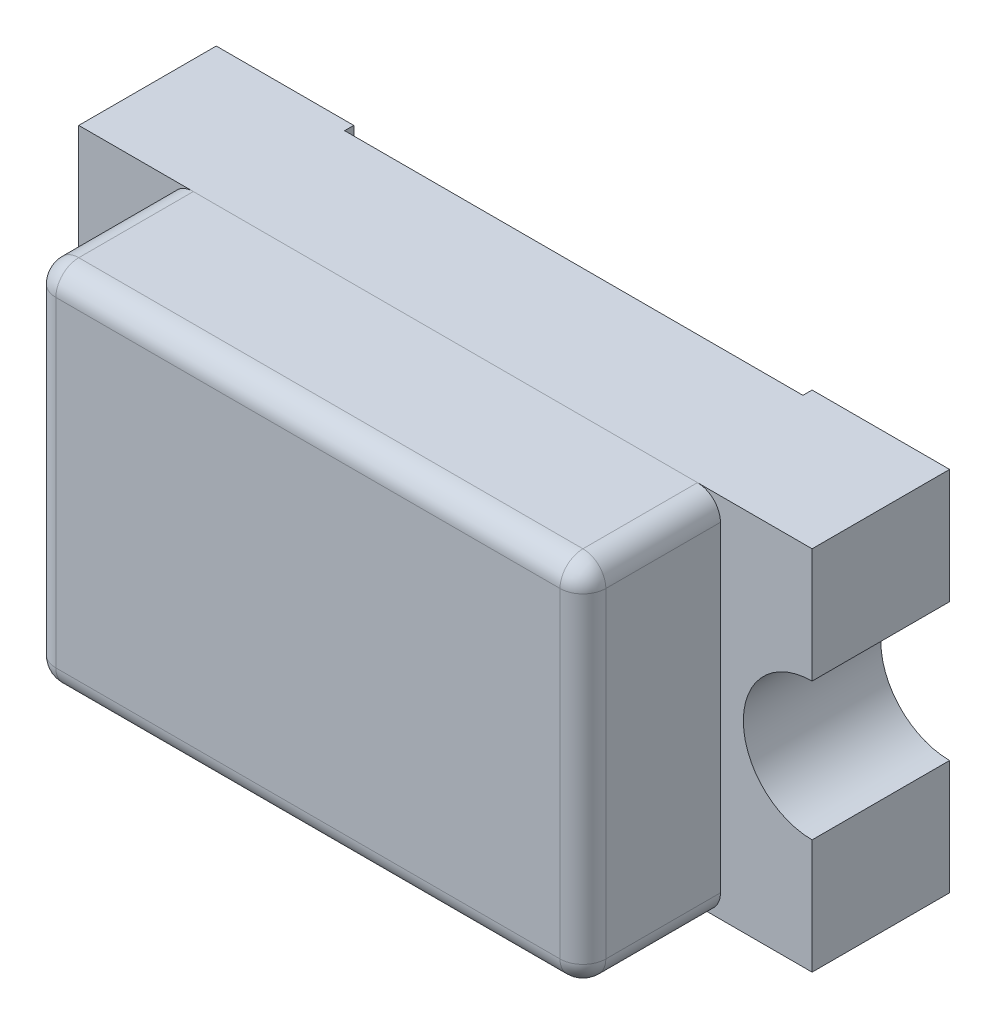
ISO-10303-21;
HEADER;
FILE_DESCRIPTION(('STEP AP214'),'2;1');
FILE_NAME('part.step','',(''),(''),'','','');
FILE_SCHEMA(('AUTOMOTIVE_DESIGN { 1 0 10303 214 1 1 1 1 }'));
ENDSEC;
DATA;
#1=APPLICATION_CONTEXT('core data for automotive mechanical design processes');
#2=APPLICATION_PROTOCOL_DEFINITION('international standard','automotive_design',2000,#1);
#3=PRODUCT_CONTEXT('',#1,'mechanical');
#4=PRODUCT('Part','Part','',(#3));
#5=PRODUCT_RELATED_PRODUCT_CATEGORY('part','',(#4));
#6=PRODUCT_DEFINITION_FORMATION('','',#4);
#7=PRODUCT_DEFINITION_CONTEXT('part definition',#1,'design');
#8=PRODUCT_DEFINITION('design','',#6,#7);
#9=PRODUCT_DEFINITION_SHAPE('','',#8);
#10=(LENGTH_UNIT() NAMED_UNIT(*) SI_UNIT(.MILLI.,.METRE.));
#11=(NAMED_UNIT(*) PLANE_ANGLE_UNIT() SI_UNIT($,.RADIAN.));
#12=(NAMED_UNIT(*) SI_UNIT($,.STERADIAN.) SOLID_ANGLE_UNIT());
#13=UNCERTAINTY_MEASURE_WITH_UNIT(LENGTH_MEASURE(1.E-05),#10,'distance_accuracy_value','');
#14=(GEOMETRIC_REPRESENTATION_CONTEXT(3) GLOBAL_UNCERTAINTY_ASSIGNED_CONTEXT((#13)) GLOBAL_UNIT_ASSIGNED_CONTEXT((#10,
#11,#12)) REPRESENTATION_CONTEXT('',''));
#15=CARTESIAN_POINT('',(0.,0.,0.));
#16=DIRECTION('',(0.,0.,1.));
#17=DIRECTION('',(1.,0.,0.));
#18=AXIS2_PLACEMENT_3D('',#15,#16,#17);
#19=CARTESIAN_POINT('',(-0.6,-0.4,0.6));
#20=DIRECTION('',(0.,0.,1.));
#21=DIRECTION('',(1.,0.,0.));
#22=AXIS2_PLACEMENT_3D('',#19,#20,#21);
#23=PLANE('',#22);
#24=DIRECTION('',(0.,1.,0.));
#25=VECTOR('',#24,1.);
#26=CARTESIAN_POINT('',(-0.55,-0.4,0.6));
#27=LINE('',#26,#25);
#28=CARTESIAN_POINT('',(-0.55,-0.35,0.6));
#29=VERTEX_POINT('',#28);
#30=CARTESIAN_POINT('',(-0.55,0.350000000000096,0.6));
#31=VERTEX_POINT('',#30);
#32=EDGE_CURVE('P0_E101',#29,#31,#27,.T.);
#33=ORIENTED_EDGE('',*,*,#32,.F.);
#34=DIRECTION('',(1.,0.,0.));
#35=VECTOR('',#34,1.);
#36=CARTESIAN_POINT('',(-0.6,-0.35,0.6));
#37=LINE('',#36,#35);
#38=CARTESIAN_POINT('',(0.55,-0.35,0.6));
#39=VERTEX_POINT('',#38);
#40=EDGE_CURVE('P0_E143',#39,#29,#37,.F.);
#41=ORIENTED_EDGE('',*,*,#40,.F.);
#42=DIRECTION('',(0.,1.,0.));
#43=VECTOR('',#42,1.);
#44=CARTESIAN_POINT('',(0.55,-0.4,0.6));
#45=LINE('',#44,#43);
#46=CARTESIAN_POINT('',(0.55,0.350000000000048,0.6));
#47=VERTEX_POINT('',#46);
#48=EDGE_CURVE('P0_E116',#47,#39,#45,.F.);
#49=ORIENTED_EDGE('',*,*,#48,.F.);
#50=DIRECTION('',(1.,0.,0.));
#51=VECTOR('',#50,1.);
#52=CARTESIAN_POINT('',(-0.6,0.350000000000096,0.6));
#53=LINE('',#52,#51);
#54=EDGE_CURVE('P0_E113',#31,#47,#53,.T.);
#55=ORIENTED_EDGE('',*,*,#54,.F.);
#56=EDGE_LOOP('',(#33,#41,#49,#55));
#57=FACE_BOUND('',#56,.T.);
#58=ADVANCED_FACE('P0_F17',(#57),#23,.T.);
#59=CARTESIAN_POINT('',(-0.55,0.35,0.55));
#60=DIRECTION('',(-1.,0.,0.));
#61=DIRECTION('',(0.,-3.82940633443145E-12,-1.));
#62=AXIS2_PLACEMENT_3D('',#59,#60,#61);
#63=SPHERICAL_SURFACE('',#62,0.0499999999999998);
#64=CARTESIAN_POINT('',(-0.55,0.35,0.55));
#65=DIRECTION('',(0.,0.,1.));
#66=DIRECTION('',(1.,0.,0.));
#67=AXIS2_PLACEMENT_3D('',#64,#65,#66);
#68=CIRCLE('',#67,0.05);
#69=CARTESIAN_POINT('',(-0.6,0.350000000000024,0.55));
#70=VERTEX_POINT('',#69);
#71=CARTESIAN_POINT('',(-0.55,0.4,0.55));
#72=VERTEX_POINT('',#71);
#73=EDGE_CURVE('P0_E118',#70,#72,#68,.F.);
#74=ORIENTED_EDGE('',*,*,#73,.F.);
#75=CARTESIAN_POINT('',(-0.55,0.350000000000096,0.55));
#76=DIRECTION('',(0.,1.,0.));
#77=DIRECTION('',(0.,0.,1.));
#78=AXIS2_PLACEMENT_3D('',#75,#76,#77);
#79=CIRCLE('',#78,0.05);
#80=EDGE_CURVE('P0_E106',#31,#70,#79,.F.);
#81=ORIENTED_EDGE('',*,*,#80,.F.);
#82=CARTESIAN_POINT('',(-0.55,0.35,0.55));
#83=DIRECTION('',(1.,0.,0.));
#84=DIRECTION('',(0.,0.,-1.));
#85=AXIS2_PLACEMENT_3D('',#82,#83,#84);
#86=CIRCLE('',#85,0.05);
#87=EDGE_CURVE('P0_E119',#72,#31,#86,.T.);
#88=ORIENTED_EDGE('',*,*,#87,.F.);
#89=EDGE_LOOP('',(#74,#81,#88));
#90=FACE_BOUND('',#89,.T.);
#91=ADVANCED_FACE('P0_F127',(#90),#63,.T.);
#92=CARTESIAN_POINT('',(-0.55,-0.4,0.55));
#93=DIRECTION('',(0.,1.,0.));
#94=DIRECTION('',(0.,0.,1.));
#95=AXIS2_PLACEMENT_3D('',#92,#93,#94);
#96=CYLINDRICAL_SURFACE('',#95,0.05);
#97=CARTESIAN_POINT('',(-0.55,-0.35,0.55));
#98=DIRECTION('',(0.,-1.,0.));
#99=DIRECTION('',(0.,0.,-1.));
#100=AXIS2_PLACEMENT_3D('',#97,#98,#99);
#101=CIRCLE('',#100,0.05);
#102=CARTESIAN_POINT('',(-0.6,-0.35,0.55));
#103=VERTEX_POINT('',#102);
#104=EDGE_CURVE('P0_E108',#29,#103,#101,.T.);
#105=ORIENTED_EDGE('',*,*,#104,.F.);
#106=ORIENTED_EDGE('',*,*,#32,.T.);
#107=ORIENTED_EDGE('',*,*,#80,.T.);
#108=DIRECTION('',(0.,1.,0.));
#109=VECTOR('',#108,1.);
#110=CARTESIAN_POINT('',(-0.6,-0.4,0.55));
#111=LINE('',#110,#109);
#112=EDGE_CURVE('P0_E205',#70,#103,#111,.F.);
#113=ORIENTED_EDGE('',*,*,#112,.T.);
#114=EDGE_LOOP('',(#105,#106,#107,#113));
#115=FACE_BOUND('',#114,.T.);
#116=ADVANCED_FACE('P0_F103',(#115),#96,.T.);
#117=CARTESIAN_POINT('',(-0.55,-0.35,0.55));
#118=DIRECTION('',(-1.,0.,0.));
#119=DIRECTION('',(0.,1.,0.));
#120=AXIS2_PLACEMENT_3D('',#117,#118,#119);
#121=SPHERICAL_SURFACE('',#120,0.05);
#122=ORIENTED_EDGE('',*,*,#104,.T.);
#123=CARTESIAN_POINT('',(-0.55,-0.35,0.55));
#124=DIRECTION('',(0.,0.,1.));
#125=DIRECTION('',(1.,0.,0.));
#126=AXIS2_PLACEMENT_3D('',#123,#124,#125);
#127=CIRCLE('',#126,0.05);
#128=CARTESIAN_POINT('',(-0.55,-0.4,0.55));
#129=VERTEX_POINT('',#128);
#130=EDGE_CURVE('P0_E199',#129,#103,#127,.F.);
#131=ORIENTED_EDGE('',*,*,#130,.F.);
#132=CARTESIAN_POINT('',(-0.55,-0.35,0.55));
#133=DIRECTION('',(1.,0.,0.));
#134=DIRECTION('',(0.,0.,-1.));
#135=AXIS2_PLACEMENT_3D('',#132,#133,#134);
#136=CIRCLE('',#135,0.05);
#137=EDGE_CURVE('P0_E145',#29,#129,#136,.T.);
#138=ORIENTED_EDGE('',*,*,#137,.F.);
#139=EDGE_LOOP('',(#122,#131,#138));
#140=FACE_BOUND('',#139,.T.);
#141=ADVANCED_FACE('P0_F256',(#140),#121,.T.);
#142=CARTESIAN_POINT('',(-0.6,-0.35,0.55));
#143=DIRECTION('',(1.,0.,0.));
#144=DIRECTION('',(0.,0.,-1.));
#145=AXIS2_PLACEMENT_3D('',#142,#143,#144);
#146=CYLINDRICAL_SURFACE('',#145,0.05);
#147=DIRECTION('',(1.,0.,0.));
#148=VECTOR('',#147,1.);
#149=CARTESIAN_POINT('',(-0.6,-0.4,0.55));
#150=LINE('',#149,#148);
#151=CARTESIAN_POINT('',(0.55,-0.4,0.55));
#152=VERTEX_POINT('',#151);
#153=EDGE_CURVE('P0_E190',#129,#152,#150,.T.);
#154=ORIENTED_EDGE('',*,*,#153,.T.);
#155=CARTESIAN_POINT('',(0.55,-0.35,0.55));
#156=DIRECTION('',(1.,0.,0.));
#157=DIRECTION('',(0.,0.,-1.));
#158=AXIS2_PLACEMENT_3D('',#155,#156,#157);
#159=CIRCLE('',#158,0.0500000000000001);
#160=EDGE_CURVE('P0_E140',#39,#152,#159,.T.);
#161=ORIENTED_EDGE('',*,*,#160,.F.);
#162=ORIENTED_EDGE('',*,*,#40,.T.);
#163=ORIENTED_EDGE('',*,*,#137,.T.);
#164=EDGE_LOOP('',(#154,#161,#162,#163));
#165=FACE_BOUND('',#164,.T.);
#166=ADVANCED_FACE('P0_F310',(#165),#146,.T.);
#167=CARTESIAN_POINT('',(0.55,-0.35,0.55));
#168=DIRECTION('',(1.,0.,0.));
#169=DIRECTION('',(0.,0.,-1.));
#170=AXIS2_PLACEMENT_3D('',#167,#168,#169);
#171=SPHERICAL_SURFACE('',#170,0.0500000000000001);
#172=CARTESIAN_POINT('',(0.55,-0.35,0.55));
#173=DIRECTION('',(0.,0.,1.));
#174=DIRECTION('',(1.,0.,0.));
#175=AXIS2_PLACEMENT_3D('',#172,#173,#174);
#176=CIRCLE('',#175,0.05);
#177=CARTESIAN_POINT('',(0.6,-0.35,0.55));
#178=VERTEX_POINT('',#177);
#179=EDGE_CURVE('P0_E189',#178,#152,#176,.F.);
#180=ORIENTED_EDGE('',*,*,#179,.F.);
#181=CARTESIAN_POINT('',(0.55,-0.35,0.55));
#182=DIRECTION('',(0.,1.,0.));
#183=DIRECTION('',(0.,0.,1.));
#184=AXIS2_PLACEMENT_3D('',#181,#182,#183);
#185=CIRCLE('',#184,0.05);
#186=EDGE_CURVE('P0_E139',#39,#178,#185,.T.);
#187=ORIENTED_EDGE('',*,*,#186,.F.);
#188=ORIENTED_EDGE('',*,*,#160,.T.);
#189=EDGE_LOOP('',(#180,#187,#188));
#190=FACE_BOUND('',#189,.T.);
#191=ADVANCED_FACE('P0_F307',(#190),#171,.T.);
#192=CARTESIAN_POINT('',(0.55,-0.4,0.55));
#193=DIRECTION('',(0.,1.,0.));
#194=DIRECTION('',(0.,0.,1.));
#195=AXIS2_PLACEMENT_3D('',#192,#193,#194);
#196=CYLINDRICAL_SURFACE('',#195,0.05);
#197=DIRECTION('',(0.,1.,0.));
#198=VECTOR('',#197,1.);
#199=CARTESIAN_POINT('',(0.6,-0.4,0.55));
#200=LINE('',#199,#198);
#201=CARTESIAN_POINT('',(0.6,0.35,0.55));
#202=VERTEX_POINT('',#201);
#203=EDGE_CURVE('P0_E184',#202,#178,#200,.F.);
#204=ORIENTED_EDGE('',*,*,#203,.F.);
#205=CARTESIAN_POINT('',(0.55,0.35,0.55));
#206=DIRECTION('',(0.,1.,0.));
#207=DIRECTION('',(0.,0.,1.));
#208=AXIS2_PLACEMENT_3D('',#205,#206,#207);
#209=CIRCLE('',#208,0.0499999999999999);
#210=EDGE_CURVE('P0_E221',#47,#202,#209,.T.);
#211=ORIENTED_EDGE('',*,*,#210,.F.);
#212=ORIENTED_EDGE('',*,*,#48,.T.);
#213=ORIENTED_EDGE('',*,*,#186,.T.);
#214=EDGE_LOOP('',(#204,#211,#212,#213));
#215=FACE_BOUND('',#214,.T.);
#216=ADVANCED_FACE('P0_F313',(#215),#196,.T.);
#217=CARTESIAN_POINT('',(0.55,0.35,0.55));
#218=DIRECTION('',(1.,0.,0.));
#219=DIRECTION('',(0.,-1.,0.));
#220=AXIS2_PLACEMENT_3D('',#217,#218,#219);
#221=SPHERICAL_SURFACE('',#220,0.0499999999999999);
#222=ORIENTED_EDGE('',*,*,#210,.T.);
#223=CARTESIAN_POINT('',(0.55,0.35,0.55));
#224=DIRECTION('',(0.,0.,1.));
#225=DIRECTION('',(1.,0.,0.));
#226=AXIS2_PLACEMENT_3D('',#223,#224,#225);
#227=CIRCLE('',#226,0.05);
#228=CARTESIAN_POINT('',(0.55,0.4,0.55));
#229=VERTEX_POINT('',#228);
#230=EDGE_CURVE('P0_E179',#229,#202,#227,.F.);
#231=ORIENTED_EDGE('',*,*,#230,.F.);
#232=CARTESIAN_POINT('',(0.55,0.35,0.55));
#233=DIRECTION('',(1.,0.,0.));
#234=DIRECTION('',(0.,0.,-1.));
#235=AXIS2_PLACEMENT_3D('',#232,#233,#234);
#236=CIRCLE('',#235,0.05);
#237=EDGE_CURVE('P0_E67',#47,#229,#236,.F.);
#238=ORIENTED_EDGE('',*,*,#237,.F.);
#239=EDGE_LOOP('',(#222,#231,#238));
#240=FACE_BOUND('',#239,.T.);
#241=ADVANCED_FACE('P0_F19',(#240),#221,.T.);
#242=CARTESIAN_POINT('',(-0.6,0.35,0.55));
#243=DIRECTION('',(1.,0.,0.));
#244=DIRECTION('',(0.,0.,-1.));
#245=AXIS2_PLACEMENT_3D('',#242,#243,#244);
#246=CYLINDRICAL_SURFACE('',#245,0.05);
#247=ORIENTED_EDGE('',*,*,#87,.T.);
#248=ORIENTED_EDGE('',*,*,#54,.T.);
#249=ORIENTED_EDGE('',*,*,#237,.T.);
#250=DIRECTION('',(1.,0.,0.));
#251=VECTOR('',#250,1.);
#252=CARTESIAN_POINT('',(-0.6,0.4,0.55));
#253=LINE('',#252,#251);
#254=EDGE_CURVE('P0_E123',#72,#229,#253,.T.);
#255=ORIENTED_EDGE('',*,*,#254,.F.);
#256=EDGE_LOOP('',(#247,#248,#249,#255));
#257=FACE_BOUND('',#256,.T.);
#258=ADVANCED_FACE('P0_F122',(#257),#246,.T.);
#259=CARTESIAN_POINT('',(-0.55,0.35,0.3));
#260=DIRECTION('',(0.,0.,1.));
#261=DIRECTION('',(1.,0.,0.));
#262=AXIS2_PLACEMENT_3D('',#259,#260,#261);
#263=CYLINDRICAL_SURFACE('',#262,0.05);
#264=DIRECTION('',(0.,0.,-1.));
#265=VECTOR('',#264,1.);
#266=CARTESIAN_POINT('',(-0.6,0.35,0.3));
#267=LINE('',#266,#265);
#268=CARTESIAN_POINT('',(-0.6,0.35,0.3));
#269=VERTEX_POINT('',#268);
#270=EDGE_CURVE('P0_E202',#269,#70,#267,.F.);
#271=ORIENTED_EDGE('',*,*,#270,.T.);
#272=ORIENTED_EDGE('',*,*,#73,.T.);
#273=DIRECTION('',(0.,0.,1.));
#274=VECTOR('',#273,1.);
#275=CARTESIAN_POINT('',(-0.55,0.4,0.3));
#276=LINE('',#275,#274);
#277=CARTESIAN_POINT('',(-0.55,0.4,0.3));
#278=VERTEX_POINT('',#277);
#279=EDGE_CURVE('P0_E168',#278,#72,#276,.T.);
#280=ORIENTED_EDGE('',*,*,#279,.F.);
#281=CARTESIAN_POINT('',(-0.55,0.35,0.3));
#282=DIRECTION('',(0.,0.,1.));
#283=DIRECTION('',(1.,0.,0.));
#284=AXIS2_PLACEMENT_3D('',#281,#282,#283);
#285=CIRCLE('',#284,0.05);
#286=EDGE_CURVE('P0_E21',#278,#269,#285,.T.);
#287=ORIENTED_EDGE('',*,*,#286,.T.);
#288=EDGE_LOOP('',(#271,#272,#280,#287));
#289=FACE_BOUND('',#288,.T.);
#290=ADVANCED_FACE('P0_F261',(#289),#263,.T.);
#291=CARTESIAN_POINT('',(-0.6,-0.4,0.3));
#292=DIRECTION('',(1.,0.,0.));
#293=DIRECTION('',(0.,0.,-1.));
#294=AXIS2_PLACEMENT_3D('',#291,#292,#293);
#295=PLANE('',#294);
#296=ORIENTED_EDGE('',*,*,#270,.F.);
#297=DIRECTION('',(0.,1.,0.));
#298=VECTOR('',#297,1.);
#299=CARTESIAN_POINT('',(-0.6,-0.4,0.3));
#300=LINE('',#299,#298);
#301=CARTESIAN_POINT('',(-0.6,-0.35,0.3));
#302=VERTEX_POINT('',#301);
#303=EDGE_CURVE('P0_E158',#269,#302,#300,.F.);
#304=ORIENTED_EDGE('',*,*,#303,.T.);
#305=DIRECTION('',(0.,0.,1.));
#306=VECTOR('',#305,1.);
#307=CARTESIAN_POINT('',(-0.6,-0.35,0.3));
#308=LINE('',#307,#306);
#309=EDGE_CURVE('P0_E195',#103,#302,#308,.F.);
#310=ORIENTED_EDGE('',*,*,#309,.F.);
#311=ORIENTED_EDGE('',*,*,#112,.F.);
#312=EDGE_LOOP('',(#296,#304,#310,#311));
#313=FACE_BOUND('',#312,.T.);
#314=ADVANCED_FACE('P0_F259',(#313),#295,.F.);
#315=CARTESIAN_POINT('',(-0.55,-0.35,0.3));
#316=DIRECTION('',(0.,0.,1.));
#317=DIRECTION('',(1.,0.,0.));
#318=AXIS2_PLACEMENT_3D('',#315,#316,#317);
#319=CYLINDRICAL_SURFACE('',#318,0.05);
#320=CARTESIAN_POINT('',(-0.55,-0.35,0.3));
#321=DIRECTION('',(0.,0.,1.));
#322=DIRECTION('',(1.,0.,0.));
#323=AXIS2_PLACEMENT_3D('',#320,#321,#322);
#324=CIRCLE('',#323,0.05);
#325=CARTESIAN_POINT('',(-0.55,-0.4,0.3));
#326=VERTEX_POINT('',#325);
#327=EDGE_CURVE('P0_E156',#302,#326,#324,.T.);
#328=ORIENTED_EDGE('',*,*,#327,.T.);
#329=DIRECTION('',(0.,0.,1.));
#330=VECTOR('',#329,1.);
#331=CARTESIAN_POINT('',(-0.55,-0.4,0.3));
#332=LINE('',#331,#330);
#333=EDGE_CURVE('P0_E193',#326,#129,#332,.T.);
#334=ORIENTED_EDGE('',*,*,#333,.T.);
#335=ORIENTED_EDGE('',*,*,#130,.T.);
#336=ORIENTED_EDGE('',*,*,#309,.T.);
#337=EDGE_LOOP('',(#328,#334,#335,#336));
#338=FACE_BOUND('',#337,.T.);
#339=ADVANCED_FACE('P0_F258',(#338),#319,.T.);
#340=CARTESIAN_POINT('',(-0.6,-0.4,0.3));
#341=DIRECTION('',(0.,1.,0.));
#342=DIRECTION('',(0.,0.,1.));
#343=AXIS2_PLACEMENT_3D('',#340,#341,#342);
#344=PLANE('',#343);
#345=ORIENTED_EDGE('',*,*,#333,.F.);
#346=DIRECTION('',(1.,0.,0.));
#347=VECTOR('',#346,1.);
#348=CARTESIAN_POINT('',(-0.6,-0.4,0.3));
#349=LINE('',#348,#347);
#350=CARTESIAN_POINT('',(0.55,-0.4,0.3));
#351=VERTEX_POINT('',#350);
#352=EDGE_CURVE('P0_E155',#326,#351,#349,.T.);
#353=ORIENTED_EDGE('',*,*,#352,.T.);
#354=DIRECTION('',(0.,0.,1.));
#355=VECTOR('',#354,1.);
#356=CARTESIAN_POINT('',(0.55,-0.4,0.3));
#357=LINE('',#356,#355);
#358=EDGE_CURVE('P0_E187',#152,#351,#357,.F.);
#359=ORIENTED_EDGE('',*,*,#358,.F.);
#360=ORIENTED_EDGE('',*,*,#153,.F.);
#361=EDGE_LOOP('',(#345,#353,#359,#360));
#362=FACE_BOUND('',#361,.T.);
#363=ADVANCED_FACE('P0_F268',(#362),#344,.F.);
#364=CARTESIAN_POINT('',(0.55,-0.35,0.3));
#365=DIRECTION('',(0.,0.,1.));
#366=DIRECTION('',(1.,0.,0.));
#367=AXIS2_PLACEMENT_3D('',#364,#365,#366);
#368=CYLINDRICAL_SURFACE('',#367,0.05);
#369=DIRECTION('',(0.,0.,-1.));
#370=VECTOR('',#369,1.);
#371=CARTESIAN_POINT('',(0.6,-0.35,0.3));
#372=LINE('',#371,#370);
#373=CARTESIAN_POINT('',(0.6,-0.35,0.3));
#374=VERTEX_POINT('',#373);
#375=EDGE_CURVE('P0_E182',#178,#374,#372,.T.);
#376=ORIENTED_EDGE('',*,*,#375,.F.);
#377=ORIENTED_EDGE('',*,*,#179,.T.);
#378=ORIENTED_EDGE('',*,*,#358,.T.);
#379=CARTESIAN_POINT('',(0.55,-0.35,0.3));
#380=DIRECTION('',(0.,0.,1.));
#381=DIRECTION('',(1.,0.,0.));
#382=AXIS2_PLACEMENT_3D('',#379,#380,#381);
#383=CIRCLE('',#382,0.05);
#384=EDGE_CURVE('P0_E153',#351,#374,#383,.T.);
#385=ORIENTED_EDGE('',*,*,#384,.T.);
#386=EDGE_LOOP('',(#376,#377,#378,#385));
#387=FACE_BOUND('',#386,.T.);
#388=ADVANCED_FACE('P0_F289',(#387),#368,.T.);
#389=CARTESIAN_POINT('',(0.6,-0.4,0.3));
#390=DIRECTION('',(1.,0.,0.));
#391=DIRECTION('',(0.,0.,-1.));
#392=AXIS2_PLACEMENT_3D('',#389,#390,#391);
#393=PLANE('',#392);
#394=DIRECTION('',(0.,1.,0.));
#395=VECTOR('',#394,1.);
#396=CARTESIAN_POINT('',(0.6,-0.4,0.3));
#397=LINE('',#396,#395);
#398=CARTESIAN_POINT('',(0.6,0.35,0.3));
#399=VERTEX_POINT('',#398);
#400=EDGE_CURVE('P0_E152',#374,#399,#397,.T.);
#401=ORIENTED_EDGE('',*,*,#400,.T.);
#402=DIRECTION('',(0.,0.,1.));
#403=VECTOR('',#402,1.);
#404=CARTESIAN_POINT('',(0.6,0.35,0.3));
#405=LINE('',#404,#403);
#406=EDGE_CURVE('P0_E177',#202,#399,#405,.F.);
#407=ORIENTED_EDGE('',*,*,#406,.F.);
#408=ORIENTED_EDGE('',*,*,#203,.T.);
#409=ORIENTED_EDGE('',*,*,#375,.T.);
#410=EDGE_LOOP('',(#401,#407,#408,#409));
#411=FACE_BOUND('',#410,.T.);
#412=ADVANCED_FACE('P0_F285',(#411),#393,.T.);
#413=CARTESIAN_POINT('',(0.55,0.35,0.3));
#414=DIRECTION('',(0.,0.,1.));
#415=DIRECTION('',(1.,0.,0.));
#416=AXIS2_PLACEMENT_3D('',#413,#414,#415);
#417=CYLINDRICAL_SURFACE('',#416,0.05);
#418=CARTESIAN_POINT('',(0.55,0.35,0.3));
#419=DIRECTION('',(0.,0.,1.));
#420=DIRECTION('',(1.,0.,0.));
#421=AXIS2_PLACEMENT_3D('',#418,#419,#420);
#422=CIRCLE('',#421,0.05);
#423=CARTESIAN_POINT('',(0.55,0.4,0.3));
#424=VERTEX_POINT('',#423);
#425=EDGE_CURVE('P0_E27',#399,#424,#422,.T.);
#426=ORIENTED_EDGE('',*,*,#425,.T.);
#427=DIRECTION('',(0.,0.,1.));
#428=VECTOR('',#427,1.);
#429=CARTESIAN_POINT('',(0.55,0.4,0.3));
#430=LINE('',#429,#428);
#431=EDGE_CURVE('P0_E35',#229,#424,#430,.F.);
#432=ORIENTED_EDGE('',*,*,#431,.F.);
#433=ORIENTED_EDGE('',*,*,#230,.T.);
#434=ORIENTED_EDGE('',*,*,#406,.T.);
#435=EDGE_LOOP('',(#426,#432,#433,#434));
#436=FACE_BOUND('',#435,.T.);
#437=ADVANCED_FACE('P0_F279',(#436),#417,.T.);
#438=CARTESIAN_POINT('',(-0.6,0.4,0.3));
#439=DIRECTION('',(0.,1.,0.));
#440=DIRECTION('',(0.,0.,1.));
#441=AXIS2_PLACEMENT_3D('',#438,#439,#440);
#442=PLANE('',#441);
#443=DIRECTION('',(1.,0.,0.));
#444=VECTOR('',#443,1.);
#445=CARTESIAN_POINT('',(-0.6,0.4,0.3));
#446=LINE('',#445,#444);
#447=EDGE_CURVE('P0_E11',#424,#278,#446,.F.);
#448=ORIENTED_EDGE('',*,*,#447,.T.);
#449=ORIENTED_EDGE('',*,*,#279,.T.);
#450=ORIENTED_EDGE('',*,*,#254,.T.);
#451=ORIENTED_EDGE('',*,*,#431,.T.);
#452=EDGE_LOOP('',(#448,#449,#450,#451));
#453=FACE_BOUND('',#452,.T.);
#454=ADVANCED_FACE('P0_F274',(#453),#442,.T.);
#455=CARTESIAN_POINT('',(-0.6,-0.4,0.3));
#456=DIRECTION('',(0.,0.,1.));
#457=DIRECTION('',(1.,0.,0.));
#458=AXIS2_PLACEMENT_3D('',#455,#456,#457);
#459=PLANE('',#458);
#460=ORIENTED_EDGE('',*,*,#425,.F.);
#461=ORIENTED_EDGE('',*,*,#400,.F.);
#462=ORIENTED_EDGE('',*,*,#384,.F.);
#463=ORIENTED_EDGE('',*,*,#352,.F.);
#464=ORIENTED_EDGE('',*,*,#327,.F.);
#465=ORIENTED_EDGE('',*,*,#303,.F.);
#466=ORIENTED_EDGE('',*,*,#286,.F.);
#467=ORIENTED_EDGE('',*,*,#447,.F.);
#468=EDGE_LOOP('',(#460,#461,#462,#463,#464,#465,#466,#467));
#469=FACE_BOUND('',#468,.T.);
#470=ADVANCED_FACE('P0_F272',(#469),#459,.F.);
#471=CLOSED_SHELL('',(#58,#91,#116,#141,#166,#191,#216,#241,#258,#290,#314,#339,#363,#388,#412,
#437,#454,#470));
#472=MANIFOLD_SOLID_BREP('P0_B1',#471);
#473=CARTESIAN_POINT('',(0.,-0.1,0.5));
#474=DIRECTION('',(0.,0.,1.));
#475=DIRECTION('',(1.,0.,0.));
#476=AXIS2_PLACEMENT_3D('',#473,#474,#475);
#477=PLANE('',#476);
#478=DIRECTION('',(0.,1.,0.));
#479=VECTOR('',#478,1.);
#480=CARTESIAN_POINT('',(0.,-0.1,0.5));
#481=LINE('',#480,#479);
#482=CARTESIAN_POINT('',(0.,0.1,0.5));
#483=VERTEX_POINT('',#482);
#484=CARTESIAN_POINT('',(0.,-0.1,0.5));
#485=VERTEX_POINT('',#484);
#486=EDGE_CURVE('P1_E216',#483,#485,#481,.F.);
#487=ORIENTED_EDGE('',*,*,#486,.T.);
#488=DIRECTION('',(1.,0.,0.));
#489=VECTOR('',#488,1.);
#490=CARTESIAN_POINT('',(0.,-0.1,0.5));
#491=LINE('',#490,#489);
#492=CARTESIAN_POINT('',(0.2,-0.1,0.5));
#493=VERTEX_POINT('',#492);
#494=EDGE_CURVE('P1_E219',#485,#493,#491,.T.);
#495=ORIENTED_EDGE('',*,*,#494,.T.);
#496=DIRECTION('',(0.,1.,0.));
#497=VECTOR('',#496,1.);
#498=CARTESIAN_POINT('',(0.2,-0.1,0.5));
#499=LINE('',#498,#497);
#500=CARTESIAN_POINT('',(0.2,0.1,0.5));
#501=VERTEX_POINT('',#500);
#502=EDGE_CURVE('P1_E201',#501,#493,#499,.F.);
#503=ORIENTED_EDGE('',*,*,#502,.F.);
#504=DIRECTION('',(1.,0.,0.));
#505=VECTOR('',#504,1.);
#506=CARTESIAN_POINT('',(0.,0.1,0.5));
#507=LINE('',#506,#505);
#508=EDGE_CURVE('P1_E210',#483,#501,#507,.T.);
#509=ORIENTED_EDGE('',*,*,#508,.F.);
#510=EDGE_LOOP('',(#487,#495,#503,#509));
#511=FACE_BOUND('',#510,.T.);
#512=ADVANCED_FACE('P1_F17',(#511),#477,.T.);
#513=CARTESIAN_POINT('',(0.5,-0.4,0.));
#514=DIRECTION('',(0.,0.,1.));
#515=DIRECTION('',(1.,0.,0.));
#516=AXIS2_PLACEMENT_3D('',#513,#514,#515);
#517=PLANE('',#516);
#518=DIRECTION('',(0.,1.,0.));
#519=VECTOR('',#518,1.);
#520=CARTESIAN_POINT('',(0.8,-0.4,0.));
#521=LINE('',#520,#519);
#522=CARTESIAN_POINT('',(0.8,-0.4,0.));
#523=VERTEX_POINT('',#522);
#524=CARTESIAN_POINT('',(0.8,-0.15,0.));
#525=VERTEX_POINT('',#524);
#526=EDGE_CURVE('P1_E74',#523,#525,#521,.T.);
#527=ORIENTED_EDGE('',*,*,#526,.F.);
#528=DIRECTION('',(1.,0.,0.));
#529=VECTOR('',#528,1.);
#530=CARTESIAN_POINT('',(-0.5,-0.4,0.));
#531=LINE('',#530,#529);
#532=CARTESIAN_POINT('',(0.5,-0.4,0.));
#533=VERTEX_POINT('',#532);
#534=EDGE_CURVE('P1_E103',#523,#533,#531,.F.);
#535=ORIENTED_EDGE('',*,*,#534,.T.);
#536=DIRECTION('',(0.,1.,0.));
#537=VECTOR('',#536,1.);
#538=CARTESIAN_POINT('',(0.5,-0.4,0.));
#539=LINE('',#538,#537);
#540=CARTESIAN_POINT('',(0.5,0.4,0.));
#541=VERTEX_POINT('',#540);
#542=EDGE_CURVE('P1_E97',#533,#541,#539,.T.);
#543=ORIENTED_EDGE('',*,*,#542,.T.);
#544=DIRECTION('',(1.,0.,0.));
#545=VECTOR('',#544,1.);
#546=CARTESIAN_POINT('',(-0.5,0.4,0.));
#547=LINE('',#546,#545);
#548=CARTESIAN_POINT('',(0.8,0.4,0.));
#549=VERTEX_POINT('',#548);
#550=EDGE_CURVE('P1_E101',#549,#541,#547,.F.);
#551=ORIENTED_EDGE('',*,*,#550,.F.);
#552=DIRECTION('',(0.,1.,0.));
#553=VECTOR('',#552,1.);
#554=CARTESIAN_POINT('',(0.8,-0.4,0.));
#555=LINE('',#554,#553);
#556=CARTESIAN_POINT('',(0.8,0.15,0.));
#557=VERTEX_POINT('',#556);
#558=EDGE_CURVE('P1_E64',#557,#549,#555,.T.);
#559=ORIENTED_EDGE('',*,*,#558,.F.);
#560=CARTESIAN_POINT('',(0.8,0.,0.));
#561=DIRECTION('',(0.,0.,1.));
#562=DIRECTION('',(1.,0.,0.));
#563=AXIS2_PLACEMENT_3D('',#560,#561,#562);
#564=CIRCLE('',#563,0.15);
#565=EDGE_CURVE('P1_E20',#557,#525,#564,.T.);
#566=ORIENTED_EDGE('',*,*,#565,.T.);
#567=EDGE_LOOP('',(#527,#535,#543,#551,#559,#566));
#568=FACE_BOUND('',#567,.T.);
#569=ADVANCED_FACE('P1_F99',(#568),#517,.F.);
#570=CARTESIAN_POINT('',(0.5,-0.4,0.));
#571=DIRECTION('',(1.,0.,0.));
#572=DIRECTION('',(0.,0.,-1.));
#573=AXIS2_PLACEMENT_3D('',#570,#571,#572);
#574=PLANE('',#573);
#575=ORIENTED_EDGE('',*,*,#542,.F.);
#576=DIRECTION('',(0.,0.,1.));
#577=VECTOR('',#576,1.);
#578=CARTESIAN_POINT('',(0.5,-0.4,0.02));
#579=LINE('',#578,#577);
#580=CARTESIAN_POINT('',(0.5,-0.4,0.02));
#581=VERTEX_POINT('',#580);
#582=EDGE_CURVE('P1_E140',#533,#581,#579,.T.);
#583=ORIENTED_EDGE('',*,*,#582,.T.);
#584=DIRECTION('',(0.,1.,0.));
#585=VECTOR('',#584,1.);
#586=CARTESIAN_POINT('',(0.5,-0.4,0.02));
#587=LINE('',#586,#585);
#588=CARTESIAN_POINT('',(0.5,0.4,0.02));
#589=VERTEX_POINT('',#588);
#590=EDGE_CURVE('P1_E106',#581,#589,#587,.T.);
#591=ORIENTED_EDGE('',*,*,#590,.T.);
#592=DIRECTION('',(0.,0.,1.));
#593=VECTOR('',#592,1.);
#594=CARTESIAN_POINT('',(0.5,0.4,0.02));
#595=LINE('',#594,#593);
#596=EDGE_CURVE('P1_E109',#541,#589,#595,.T.);
#597=ORIENTED_EDGE('',*,*,#596,.F.);
#598=EDGE_LOOP('',(#575,#583,#591,#597));
#599=FACE_BOUND('',#598,.T.);
#600=ADVANCED_FACE('P1_F110',(#599),#574,.F.);
#601=CARTESIAN_POINT('',(-0.5,-0.4,0.02));
#602=DIRECTION('',(0.,0.,1.));
#603=DIRECTION('',(1.,0.,0.));
#604=AXIS2_PLACEMENT_3D('',#601,#602,#603);
#605=PLANE('',#604);
#606=DIRECTION('',(1.,0.,0.));
#607=VECTOR('',#606,1.);
#608=CARTESIAN_POINT('',(-0.5,-0.4,0.02));
#609=LINE('',#608,#607);
#610=CARTESIAN_POINT('',(-0.5,-0.4,0.02));
#611=VERTEX_POINT('',#610);
#612=EDGE_CURVE('P1_E146',#581,#611,#609,.F.);
#613=ORIENTED_EDGE('',*,*,#612,.T.);
#614=DIRECTION('',(0.,1.,0.));
#615=VECTOR('',#614,1.);
#616=CARTESIAN_POINT('',(-0.5,0.4,0.02));
#617=LINE('',#616,#615);
#618=CARTESIAN_POINT('',(-0.5,0.4,0.02));
#619=VERTEX_POINT('',#618);
#620=EDGE_CURVE('P1_E238',#611,#619,#617,.T.);
#621=ORIENTED_EDGE('',*,*,#620,.T.);
#622=DIRECTION('',(1.,0.,0.));
#623=VECTOR('',#622,1.);
#624=CARTESIAN_POINT('',(-0.5,0.4,0.02));
#625=LINE('',#624,#623);
#626=EDGE_CURVE('P1_E115',#589,#619,#625,.F.);
#627=ORIENTED_EDGE('',*,*,#626,.F.);
#628=ORIENTED_EDGE('',*,*,#590,.F.);
#629=EDGE_LOOP('',(#613,#621,#627,#628));
#630=FACE_BOUND('',#629,.T.);
#631=ADVANCED_FACE('P1_F257',(#630),#605,.F.);
#632=CARTESIAN_POINT('',(-0.5,0.4,0.));
#633=DIRECTION('',(-1.,0.,0.));
#634=DIRECTION('',(0.,0.,1.));
#635=AXIS2_PLACEMENT_3D('',#632,#633,#634);
#636=PLANE('',#635);
#637=DIRECTION('',(0.,1.,0.));
#638=VECTOR('',#637,1.);
#639=CARTESIAN_POINT('',(-0.5,0.4,0.));
#640=LINE('',#639,#638);
#641=CARTESIAN_POINT('',(-0.5,-0.4,0.));
#642=VERTEX_POINT('',#641);
#643=CARTESIAN_POINT('',(-0.5,0.4,0.));
#644=VERTEX_POINT('',#643);
#645=EDGE_CURVE('P1_E221',#642,#644,#640,.T.);
#646=ORIENTED_EDGE('',*,*,#645,.T.);
#647=DIRECTION('',(0.,0.,1.));
#648=VECTOR('',#647,1.);
#649=CARTESIAN_POINT('',(-0.5,0.4,0.02));
#650=LINE('',#649,#648);
#651=EDGE_CURVE('P1_E234',#619,#644,#650,.F.);
#652=ORIENTED_EDGE('',*,*,#651,.F.);
#653=ORIENTED_EDGE('',*,*,#620,.F.);
#654=DIRECTION('',(0.,0.,1.));
#655=VECTOR('',#654,1.);
#656=CARTESIAN_POINT('',(-0.5,-0.4,0.02));
#657=LINE('',#656,#655);
#658=EDGE_CURVE('P1_E144',#611,#642,#657,.F.);
#659=ORIENTED_EDGE('',*,*,#658,.T.);
#660=EDGE_LOOP('',(#646,#652,#653,#659));
#661=FACE_BOUND('',#660,.T.);
#662=ADVANCED_FACE('P1_F262',(#661),#636,.F.);
#663=CARTESIAN_POINT('',(-0.5,0.4,0.));
#664=DIRECTION('',(0.,0.,1.));
#665=DIRECTION('',(1.,0.,0.));
#666=AXIS2_PLACEMENT_3D('',#663,#664,#665);
#667=PLANE('',#666);
#668=DIRECTION('',(0.,1.,0.));
#669=VECTOR('',#668,1.);
#670=CARTESIAN_POINT('',(-0.8,0.4,0.));
#671=LINE('',#670,#669);
#672=CARTESIAN_POINT('',(-0.8,0.4,0.));
#673=VERTEX_POINT('',#672);
#674=CARTESIAN_POINT('',(-0.8,0.15,0.));
#675=VERTEX_POINT('',#674);
#676=EDGE_CURVE('P1_E177',#673,#675,#671,.F.);
#677=ORIENTED_EDGE('',*,*,#676,.F.);
#678=DIRECTION('',(1.,0.,0.));
#679=VECTOR('',#678,1.);
#680=CARTESIAN_POINT('',(-0.5,0.4,0.));
#681=LINE('',#680,#679);
#682=EDGE_CURVE('P1_E230',#644,#673,#681,.F.);
#683=ORIENTED_EDGE('',*,*,#682,.F.);
#684=ORIENTED_EDGE('',*,*,#645,.F.);
#685=DIRECTION('',(1.,0.,0.));
#686=VECTOR('',#685,1.);
#687=CARTESIAN_POINT('',(-0.5,-0.4,0.));
#688=LINE('',#687,#686);
#689=CARTESIAN_POINT('',(-0.8,-0.4,0.));
#690=VERTEX_POINT('',#689);
#691=EDGE_CURVE('P1_E136',#642,#690,#688,.F.);
#692=ORIENTED_EDGE('',*,*,#691,.T.);
#693=DIRECTION('',(0.,1.,0.));
#694=VECTOR('',#693,1.);
#695=CARTESIAN_POINT('',(-0.8,0.4,0.));
#696=LINE('',#695,#694);
#697=CARTESIAN_POINT('',(-0.8,-0.15,0.));
#698=VERTEX_POINT('',#697);
#699=EDGE_CURVE('P1_E162',#698,#690,#696,.F.);
#700=ORIENTED_EDGE('',*,*,#699,.F.);
#701=CARTESIAN_POINT('',(-0.8,0.,0.));
#702=DIRECTION('',(0.,0.,1.));
#703=DIRECTION('',(1.,0.,0.));
#704=AXIS2_PLACEMENT_3D('',#701,#702,#703);
#705=CIRCLE('',#704,0.15);
#706=EDGE_CURVE('P1_E161',#698,#675,#705,.T.);
#707=ORIENTED_EDGE('',*,*,#706,.T.);
#708=EDGE_LOOP('',(#677,#683,#684,#692,#700,#707));
#709=FACE_BOUND('',#708,.T.);
#710=ADVANCED_FACE('P1_F266',(#709),#667,.F.);
#711=CARTESIAN_POINT('',(0.,-0.1,0.3));
#712=DIRECTION('',(0.,1.,0.));
#713=DIRECTION('',(0.,0.,1.));
#714=AXIS2_PLACEMENT_3D('',#711,#712,#713);
#715=PLANE('',#714);
#716=DIRECTION('',(0.,0.,-1.));
#717=VECTOR('',#716,1.);
#718=CARTESIAN_POINT('',(0.,-0.1,0.3));
#719=LINE('',#718,#717);
#720=CARTESIAN_POINT('',(0.,-0.1,0.3));
#721=VERTEX_POINT('',#720);
#722=EDGE_CURVE('P1_E213',#485,#721,#719,.T.);
#723=ORIENTED_EDGE('',*,*,#722,.T.);
#724=DIRECTION('',(1.,0.,0.));
#725=VECTOR('',#724,1.);
#726=CARTESIAN_POINT('',(-0.5,-0.1,0.3));
#727=LINE('',#726,#725);
#728=CARTESIAN_POINT('',(0.2,-0.1,0.3));
#729=VERTEX_POINT('',#728);
#730=EDGE_CURVE('P1_E325',#729,#721,#727,.F.);
#731=ORIENTED_EDGE('',*,*,#730,.F.);
#732=DIRECTION('',(0.,0.,-1.));
#733=VECTOR('',#732,1.);
#734=CARTESIAN_POINT('',(0.2,-0.1,0.3));
#735=LINE('',#734,#733);
#736=EDGE_CURVE('P1_E141',#493,#729,#735,.T.);
#737=ORIENTED_EDGE('',*,*,#736,.F.);
#738=ORIENTED_EDGE('',*,*,#494,.F.);
#739=EDGE_LOOP('',(#723,#731,#737,#738));
#740=FACE_BOUND('',#739,.T.);
#741=ADVANCED_FACE('P1_F352',(#740),#715,.F.);
#742=CARTESIAN_POINT('',(0.,-0.1,0.3));
#743=DIRECTION('',(1.,0.,0.));
#744=DIRECTION('',(0.,0.,-1.));
#745=AXIS2_PLACEMENT_3D('',#742,#743,#744);
#746=PLANE('',#745);
#747=DIRECTION('',(0.,1.,0.));
#748=VECTOR('',#747,1.);
#749=CARTESIAN_POINT('',(0.,-0.4,0.3));
#750=LINE('',#749,#748);
#751=CARTESIAN_POINT('',(0.,0.1,0.3));
#752=VERTEX_POINT('',#751);
#753=EDGE_CURVE('P1_E315',#721,#752,#750,.T.);
#754=ORIENTED_EDGE('',*,*,#753,.F.);
#755=ORIENTED_EDGE('',*,*,#722,.F.);
#756=ORIENTED_EDGE('',*,*,#486,.F.);
#757=DIRECTION('',(0.,0.,1.));
#758=VECTOR('',#757,1.);
#759=CARTESIAN_POINT('',(0.,0.1,0.3));
#760=LINE('',#759,#758);
#761=EDGE_CURVE('P1_E207',#752,#483,#760,.T.);
#762=ORIENTED_EDGE('',*,*,#761,.F.);
#763=EDGE_LOOP('',(#754,#755,#756,#762));
#764=FACE_BOUND('',#763,.T.);
#765=ADVANCED_FACE('P1_F312',(#764),#746,.F.);
#766=CARTESIAN_POINT('',(0.,0.1,0.3));
#767=DIRECTION('',(0.,1.,0.));
#768=DIRECTION('',(0.,0.,1.));
#769=AXIS2_PLACEMENT_3D('',#766,#767,#768);
#770=PLANE('',#769);
#771=DIRECTION('',(1.,0.,0.));
#772=VECTOR('',#771,1.);
#773=CARTESIAN_POINT('',(-0.5,0.1,0.3));
#774=LINE('',#773,#772);
#775=CARTESIAN_POINT('',(0.2,0.1,0.3));
#776=VERTEX_POINT('',#775);
#777=EDGE_CURVE('P1_E319',#752,#776,#774,.T.);
#778=ORIENTED_EDGE('',*,*,#777,.F.);
#779=ORIENTED_EDGE('',*,*,#761,.T.);
#780=ORIENTED_EDGE('',*,*,#508,.T.);
#781=DIRECTION('',(0.,0.,-1.));
#782=VECTOR('',#781,1.);
#783=CARTESIAN_POINT('',(0.2,0.1,0.3));
#784=LINE('',#783,#782);
#785=EDGE_CURVE('P1_E204',#776,#501,#784,.F.);
#786=ORIENTED_EDGE('',*,*,#785,.F.);
#787=EDGE_LOOP('',(#778,#779,#780,#786));
#788=FACE_BOUND('',#787,.T.);
#789=ADVANCED_FACE('P1_F320',(#788),#770,.T.);
#790=CARTESIAN_POINT('',(0.2,-0.1,0.3));
#791=DIRECTION('',(1.,0.,0.));
#792=DIRECTION('',(0.,0.,-1.));
#793=AXIS2_PLACEMENT_3D('',#790,#791,#792);
#794=PLANE('',#793);
#795=ORIENTED_EDGE('',*,*,#736,.T.);
#796=DIRECTION('',(0.,1.,0.));
#797=VECTOR('',#796,1.);
#798=CARTESIAN_POINT('',(0.2,-0.4,0.3));
#799=LINE('',#798,#797);
#800=EDGE_CURVE('P1_E323',#776,#729,#799,.F.);
#801=ORIENTED_EDGE('',*,*,#800,.F.);
#802=ORIENTED_EDGE('',*,*,#785,.T.);
#803=ORIENTED_EDGE('',*,*,#502,.T.);
#804=EDGE_LOOP('',(#795,#801,#802,#803));
#805=FACE_BOUND('',#804,.T.);
#806=ADVANCED_FACE('P1_F347',(#805),#794,.T.);
#807=CARTESIAN_POINT('',(-0.5,-0.4,0.02));
#808=DIRECTION('',(0.,1.,0.));
#809=DIRECTION('',(0.,0.,1.));
#810=AXIS2_PLACEMENT_3D('',#807,#808,#809);
#811=PLANE('',#810);
#812=DIRECTION('',(0.,0.,1.));
#813=VECTOR('',#812,1.);
#814=CARTESIAN_POINT('',(-0.8,-0.4,0.));
#815=LINE('',#814,#813);
#816=CARTESIAN_POINT('',(-0.8,-0.4,0.3));
#817=VERTEX_POINT('',#816);
#818=EDGE_CURVE('P1_E169',#690,#817,#815,.T.);
#819=ORIENTED_EDGE('',*,*,#818,.F.);
#820=ORIENTED_EDGE('',*,*,#691,.F.);
#821=ORIENTED_EDGE('',*,*,#658,.F.);
#822=ORIENTED_EDGE('',*,*,#612,.F.);
#823=ORIENTED_EDGE('',*,*,#582,.F.);
#824=ORIENTED_EDGE('',*,*,#534,.F.);
#825=DIRECTION('',(0.,0.,-1.));
#826=VECTOR('',#825,1.);
#827=CARTESIAN_POINT('',(0.8,-0.4,0.));
#828=LINE('',#827,#826);
#829=CARTESIAN_POINT('',(0.8,-0.4,0.3));
#830=VERTEX_POINT('',#829);
#831=EDGE_CURVE('P1_E135',#830,#523,#828,.T.);
#832=ORIENTED_EDGE('',*,*,#831,.F.);
#833=DIRECTION('',(1.,0.,0.));
#834=VECTOR('',#833,1.);
#835=CARTESIAN_POINT('',(-0.5,-0.4,0.3));
#836=LINE('',#835,#834);
#837=EDGE_CURVE('P1_E287',#817,#830,#836,.T.);
#838=ORIENTED_EDGE('',*,*,#837,.F.);
#839=EDGE_LOOP('',(#819,#820,#821,#822,#823,#824,#832,#838));
#840=FACE_BOUND('',#839,.T.);
#841=ADVANCED_FACE('P1_F386',(#840),#811,.F.);
#842=CARTESIAN_POINT('',(0.8,-0.4,0.));
#843=DIRECTION('',(1.,0.,0.));
#844=DIRECTION('',(0.,0.,-1.));
#845=AXIS2_PLACEMENT_3D('',#842,#843,#844);
#846=PLANE('',#845);
#847=DIRECTION('',(0.,1.,0.));
#848=VECTOR('',#847,1.);
#849=CARTESIAN_POINT('',(0.8,-0.4,0.3));
#850=LINE('',#849,#848);
#851=CARTESIAN_POINT('',(0.8,-0.15,0.3));
#852=VERTEX_POINT('',#851);
#853=EDGE_CURVE('P1_E160',#830,#852,#850,.T.);
#854=ORIENTED_EDGE('',*,*,#853,.F.);
#855=ORIENTED_EDGE('',*,*,#831,.T.);
#856=ORIENTED_EDGE('',*,*,#526,.T.);
#857=DIRECTION('',(0.,0.,1.));
#858=VECTOR('',#857,1.);
#859=CARTESIAN_POINT('',(0.8,-0.15,0.));
#860=LINE('',#859,#858);
#861=EDGE_CURVE('P1_E131',#525,#852,#860,.T.);
#862=ORIENTED_EDGE('',*,*,#861,.T.);
#863=EDGE_LOOP('',(#854,#855,#856,#862));
#864=FACE_BOUND('',#863,.T.);
#865=ADVANCED_FACE('P1_F382',(#864),#846,.T.);
#866=CARTESIAN_POINT('',(0.8,0.,0.));
#867=DIRECTION('',(0.,0.,1.));
#868=DIRECTION('',(1.,0.,0.));
#869=AXIS2_PLACEMENT_3D('',#866,#867,#868);
#870=CYLINDRICAL_SURFACE('',#869,0.15);
#871=ORIENTED_EDGE('',*,*,#565,.F.);
#872=DIRECTION('',(0.,0.,-1.));
#873=VECTOR('',#872,1.);
#874=CARTESIAN_POINT('',(0.8,0.15,0.));
#875=LINE('',#874,#873);
#876=CARTESIAN_POINT('',(0.8,0.15,0.3));
#877=VERTEX_POINT('',#876);
#878=EDGE_CURVE('P1_E123',#877,#557,#875,.T.);
#879=ORIENTED_EDGE('',*,*,#878,.F.);
#880=CARTESIAN_POINT('',(0.8,0.,0.3));
#881=DIRECTION('',(0.,0.,1.));
#882=DIRECTION('',(1.,0.,0.));
#883=AXIS2_PLACEMENT_3D('',#880,#881,#882);
#884=CIRCLE('',#883,0.15);
#885=EDGE_CURVE('P1_E157',#852,#877,#884,.F.);
#886=ORIENTED_EDGE('',*,*,#885,.F.);
#887=ORIENTED_EDGE('',*,*,#861,.F.);
#888=EDGE_LOOP('',(#871,#879,#886,#887));
#889=FACE_BOUND('',#888,.T.);
#890=ADVANCED_FACE('P1_F379',(#889),#870,.F.);
#891=CARTESIAN_POINT('',(0.8,-0.4,0.));
#892=DIRECTION('',(1.,0.,0.));
#893=DIRECTION('',(0.,0.,-1.));
#894=AXIS2_PLACEMENT_3D('',#891,#892,#893);
#895=PLANE('',#894);
#896=DIRECTION('',(0.,1.,0.));
#897=VECTOR('',#896,1.);
#898=CARTESIAN_POINT('',(0.8,-0.4,0.3));
#899=LINE('',#898,#897);
#900=CARTESIAN_POINT('',(0.8,0.4,0.3));
#901=VERTEX_POINT('',#900);
#902=EDGE_CURVE('P1_E159',#877,#901,#899,.T.);
#903=ORIENTED_EDGE('',*,*,#902,.F.);
#904=ORIENTED_EDGE('',*,*,#878,.T.);
#905=ORIENTED_EDGE('',*,*,#558,.T.);
#906=DIRECTION('',(0.,0.,1.));
#907=VECTOR('',#906,1.);
#908=CARTESIAN_POINT('',(0.8,0.4,0.02));
#909=LINE('',#908,#907);
#910=EDGE_CURVE('P1_E121',#901,#549,#909,.F.);
#911=ORIENTED_EDGE('',*,*,#910,.F.);
#912=EDGE_LOOP('',(#903,#904,#905,#911));
#913=FACE_BOUND('',#912,.T.);
#914=ADVANCED_FACE('P1_F376',(#913),#895,.T.);
#915=CARTESIAN_POINT('',(-0.5,0.4,0.02));
#916=DIRECTION('',(0.,1.,0.));
#917=DIRECTION('',(0.,0.,1.));
#918=AXIS2_PLACEMENT_3D('',#915,#916,#917);
#919=PLANE('',#918);
#920=ORIENTED_EDGE('',*,*,#682,.T.);
#921=DIRECTION('',(0.,0.,1.));
#922=VECTOR('',#921,1.);
#923=CARTESIAN_POINT('',(-0.8,0.4,0.));
#924=LINE('',#923,#922);
#925=CARTESIAN_POINT('',(-0.8,0.4,0.3));
#926=VERTEX_POINT('',#925);
#927=EDGE_CURVE('P1_E171',#926,#673,#924,.F.);
#928=ORIENTED_EDGE('',*,*,#927,.F.);
#929=DIRECTION('',(1.,0.,0.));
#930=VECTOR('',#929,1.);
#931=CARTESIAN_POINT('',(-0.5,0.4,0.3));
#932=LINE('',#931,#930);
#933=EDGE_CURVE('P1_E185',#901,#926,#932,.F.);
#934=ORIENTED_EDGE('',*,*,#933,.F.);
#935=ORIENTED_EDGE('',*,*,#910,.T.);
#936=ORIENTED_EDGE('',*,*,#550,.T.);
#937=ORIENTED_EDGE('',*,*,#596,.T.);
#938=ORIENTED_EDGE('',*,*,#626,.T.);
#939=ORIENTED_EDGE('',*,*,#651,.T.);
#940=EDGE_LOOP('',(#920,#928,#934,#935,#936,#937,#938,#939));
#941=FACE_BOUND('',#940,.T.);
#942=ADVANCED_FACE('P1_F118',(#941),#919,.T.);
#943=CARTESIAN_POINT('',(-0.8,0.4,0.));
#944=DIRECTION('',(-1.,0.,0.));
#945=DIRECTION('',(0.,0.,1.));
#946=AXIS2_PLACEMENT_3D('',#943,#944,#945);
#947=PLANE('',#946);
#948=DIRECTION('',(0.,1.,0.));
#949=VECTOR('',#948,1.);
#950=CARTESIAN_POINT('',(-0.8,-0.4,0.3));
#951=LINE('',#950,#949);
#952=CARTESIAN_POINT('',(-0.8,0.15,0.3));
#953=VERTEX_POINT('',#952);
#954=EDGE_CURVE('P1_E156',#926,#953,#951,.F.);
#955=ORIENTED_EDGE('',*,*,#954,.F.);
#956=ORIENTED_EDGE('',*,*,#927,.T.);
#957=ORIENTED_EDGE('',*,*,#676,.T.);
#958=DIRECTION('',(0.,0.,1.));
#959=VECTOR('',#958,1.);
#960=CARTESIAN_POINT('',(-0.8,0.15,0.));
#961=LINE('',#960,#959);
#962=EDGE_CURVE('P1_E163',#675,#953,#961,.T.);
#963=ORIENTED_EDGE('',*,*,#962,.T.);
#964=EDGE_LOOP('',(#955,#956,#957,#963));
#965=FACE_BOUND('',#964,.T.);
#966=ADVANCED_FACE('P1_F269',(#965),#947,.T.);
#967=CARTESIAN_POINT('',(-0.8,0.,0.));
#968=DIRECTION('',(0.,0.,1.));
#969=DIRECTION('',(1.,0.,0.));
#970=AXIS2_PLACEMENT_3D('',#967,#968,#969);
#971=CYLINDRICAL_SURFACE('',#970,0.15);
#972=ORIENTED_EDGE('',*,*,#706,.F.);
#973=DIRECTION('',(0.,0.,1.));
#974=VECTOR('',#973,1.);
#975=CARTESIAN_POINT('',(-0.8,-0.15,0.));
#976=LINE('',#975,#974);
#977=CARTESIAN_POINT('',(-0.8,-0.15,0.3));
#978=VERTEX_POINT('',#977);
#979=EDGE_CURVE('P1_E327',#978,#698,#976,.F.);
#980=ORIENTED_EDGE('',*,*,#979,.F.);
#981=CARTESIAN_POINT('',(-0.8,0.,0.3));
#982=DIRECTION('',(0.,0.,1.));
#983=DIRECTION('',(1.,0.,0.));
#984=AXIS2_PLACEMENT_3D('',#981,#982,#983);
#985=CIRCLE('',#984,0.15);
#986=EDGE_CURVE('P1_E26',#953,#978,#985,.F.);
#987=ORIENTED_EDGE('',*,*,#986,.F.);
#988=ORIENTED_EDGE('',*,*,#962,.F.);
#989=EDGE_LOOP('',(#972,#980,#987,#988));
#990=FACE_BOUND('',#989,.T.);
#991=ADVANCED_FACE('P1_F365',(#990),#971,.F.);
#992=CARTESIAN_POINT('',(-0.8,0.4,0.));
#993=DIRECTION('',(-1.,0.,0.));
#994=DIRECTION('',(0.,0.,1.));
#995=AXIS2_PLACEMENT_3D('',#992,#993,#994);
#996=PLANE('',#995);
#997=DIRECTION('',(0.,1.,0.));
#998=VECTOR('',#997,1.);
#999=CARTESIAN_POINT('',(-0.8,-0.4,0.3));
#1000=LINE('',#999,#998);
#1001=EDGE_CURVE('P1_E11',#978,#817,#1000,.F.);
#1002=ORIENTED_EDGE('',*,*,#1001,.F.);
#1003=ORIENTED_EDGE('',*,*,#979,.T.);
#1004=ORIENTED_EDGE('',*,*,#699,.T.);
#1005=ORIENTED_EDGE('',*,*,#818,.T.);
#1006=EDGE_LOOP('',(#1002,#1003,#1004,#1005));
#1007=FACE_BOUND('',#1006,.T.);
#1008=ADVANCED_FACE('P1_F360',(#1007),#996,.T.);
#1009=CARTESIAN_POINT('',(-0.5,-0.4,0.3));
#1010=DIRECTION('',(0.,0.,1.));
#1011=DIRECTION('',(1.,0.,0.));
#1012=AXIS2_PLACEMENT_3D('',#1009,#1010,#1011);
#1013=PLANE('',#1012);
#1014=ORIENTED_EDGE('',*,*,#986,.T.);
#1015=ORIENTED_EDGE('',*,*,#1001,.T.);
#1016=ORIENTED_EDGE('',*,*,#837,.T.);
#1017=ORIENTED_EDGE('',*,*,#853,.T.);
#1018=ORIENTED_EDGE('',*,*,#885,.T.);
#1019=ORIENTED_EDGE('',*,*,#902,.T.);
#1020=ORIENTED_EDGE('',*,*,#933,.T.);
#1021=ORIENTED_EDGE('',*,*,#954,.T.);
#1022=EDGE_LOOP('',(#1014,#1015,#1016,#1017,#1018,#1019,#1020,#1021));
#1023=FACE_BOUND('',#1022,.T.);
#1024=ORIENTED_EDGE('',*,*,#777,.T.);
#1025=ORIENTED_EDGE('',*,*,#800,.T.);
#1026=ORIENTED_EDGE('',*,*,#730,.T.);
#1027=ORIENTED_EDGE('',*,*,#753,.T.);
#1028=EDGE_LOOP('',(#1024,#1025,#1026,#1027));
#1029=FACE_BOUND('',#1028,.T.);
#1030=ADVANCED_FACE('P1_F273',(#1023,#1029),#1013,.T.);
#1031=CLOSED_SHELL('',(#512,#569,#600,#631,#662,#710,#741,#765,#789,#806,#841,#865,#890,#914,
#942,#966,#991,#1008,#1030));
#1032=MANIFOLD_SOLID_BREP('P1_B1',#1031);
#1033=ADVANCED_BREP_SHAPE_REPRESENTATION('',(#18,#472,#1032),#14);
#1034=SHAPE_DEFINITION_REPRESENTATION(#9,#1033);
ENDSEC;
END-ISO-10303-21;
